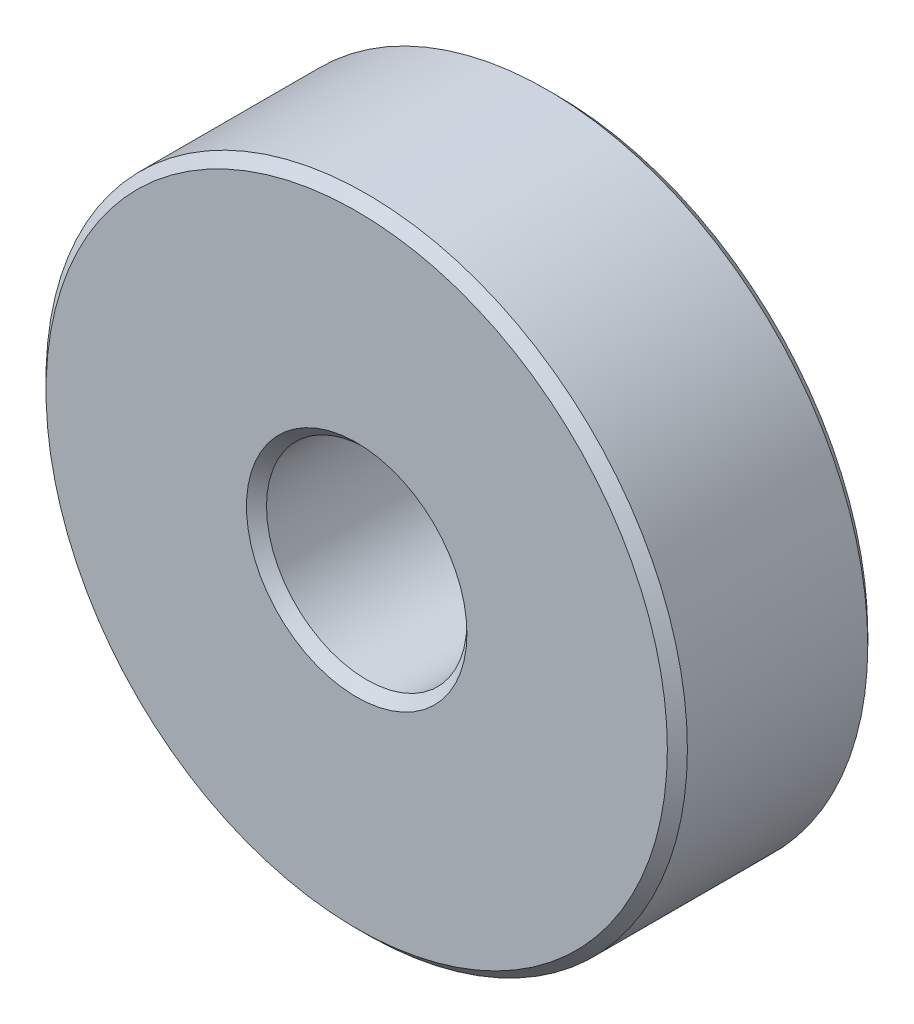
ISO-10303-21;
HEADER;
FILE_DESCRIPTION(('STEP AP214'),'2;1');
FILE_NAME('part.step','',(''),(''),'','','');
FILE_SCHEMA(('AUTOMOTIVE_DESIGN { 1 0 10303 214 1 1 1 1 }'));
ENDSEC;
DATA;
#1=APPLICATION_CONTEXT('core data for automotive mechanical design processes');
#2=APPLICATION_PROTOCOL_DEFINITION('international standard','automotive_design',2000,#1);
#3=PRODUCT_CONTEXT('',#1,'mechanical');
#4=PRODUCT('Part','Part','',(#3));
#5=PRODUCT_RELATED_PRODUCT_CATEGORY('part','',(#4));
#6=PRODUCT_DEFINITION_FORMATION('','',#4);
#7=PRODUCT_DEFINITION_CONTEXT('part definition',#1,'design');
#8=PRODUCT_DEFINITION('design','',#6,#7);
#9=PRODUCT_DEFINITION_SHAPE('','',#8);
#10=(LENGTH_UNIT() NAMED_UNIT(*) SI_UNIT(.MILLI.,.METRE.));
#11=(NAMED_UNIT(*) PLANE_ANGLE_UNIT() SI_UNIT($,.RADIAN.));
#12=(NAMED_UNIT(*) SI_UNIT($,.STERADIAN.) SOLID_ANGLE_UNIT());
#13=UNCERTAINTY_MEASURE_WITH_UNIT(LENGTH_MEASURE(1.E-05),#10,'distance_accuracy_value','');
#14=(GEOMETRIC_REPRESENTATION_CONTEXT(3) GLOBAL_UNCERTAINTY_ASSIGNED_CONTEXT((#13)) GLOBAL_UNIT_ASSIGNED_CONTEXT((#10,
#11,#12)) REPRESENTATION_CONTEXT('',''));
#15=CARTESIAN_POINT('',(0.,0.,0.));
#16=DIRECTION('',(0.,0.,1.));
#17=DIRECTION('',(1.,0.,0.));
#18=AXIS2_PLACEMENT_3D('',#15,#16,#17);
#19=CARTESIAN_POINT('',(0.,0.,2.5));
#20=DIRECTION('',(0.,0.,1.));
#21=DIRECTION('',(1.,0.,0.));
#22=AXIS2_PLACEMENT_3D('',#19,#20,#21);
#23=PLANE('',#22);
#24=CARTESIAN_POINT('',(0.,0.,2.5));
#25=DIRECTION('',(0.,0.,1.));
#26=DIRECTION('',(1.,0.,0.));
#27=AXIS2_PLACEMENT_3D('',#24,#25,#26);
#28=CIRCLE('',#27,2.75);
#29=CARTESIAN_POINT('',(2.75,0.,2.5));
#30=VERTEX_POINT('',#29);
#31=EDGE_CURVE('E42',#30,#30,#28,.F.);
#32=ORIENTED_EDGE('',*,*,#31,.T.);
#33=EDGE_LOOP('',(#32));
#34=FACE_BOUND('',#33,.T.);
#35=CARTESIAN_POINT('',(0.,0.,2.5));
#36=DIRECTION('',(0.,0.,1.));
#37=DIRECTION('',(1.,0.,0.));
#38=AXIS2_PLACEMENT_3D('',#35,#36,#37);
#39=CIRCLE('',#38,7.75);
#40=CARTESIAN_POINT('',(7.75,0.,2.5));
#41=VERTEX_POINT('',#40);
#42=EDGE_CURVE('E46',#41,#41,#39,.T.);
#43=ORIENTED_EDGE('',*,*,#42,.T.);
#44=EDGE_LOOP('',(#43));
#45=FACE_BOUND('',#44,.T.);
#46=ADVANCED_FACE('F31',(#34,#45),#23,.T.);
#47=CARTESIAN_POINT('',(0.,0.,-2.5));
#48=DIRECTION('',(0.,0.,1.));
#49=DIRECTION('',(1.,0.,0.));
#50=AXIS2_PLACEMENT_3D('',#47,#48,#49);
#51=PLANE('',#50);
#52=CARTESIAN_POINT('',(0.,0.,-2.5));
#53=DIRECTION('',(0.,0.,1.));
#54=DIRECTION('',(1.,0.,0.));
#55=AXIS2_PLACEMENT_3D('',#52,#53,#54);
#56=CIRCLE('',#55,2.75);
#57=CARTESIAN_POINT('',(2.75,0.,-2.5));
#58=VERTEX_POINT('',#57);
#59=EDGE_CURVE('E57',#58,#58,#56,.T.);
#60=ORIENTED_EDGE('',*,*,#59,.T.);
#61=EDGE_LOOP('',(#60));
#62=FACE_BOUND('',#61,.T.);
#63=CARTESIAN_POINT('',(0.,0.,-2.5));
#64=DIRECTION('',(0.,0.,1.));
#65=DIRECTION('',(1.,0.,0.));
#66=AXIS2_PLACEMENT_3D('',#63,#64,#65);
#67=CIRCLE('',#66,7.75);
#68=CARTESIAN_POINT('',(7.75,0.,-2.5));
#69=VERTEX_POINT('',#68);
#70=EDGE_CURVE('E60',#69,#69,#67,.F.);
#71=ORIENTED_EDGE('',*,*,#70,.T.);
#72=EDGE_LOOP('',(#71));
#73=FACE_BOUND('',#72,.T.);
#74=ADVANCED_FACE('F64',(#62,#73),#51,.F.);
#75=CARTESIAN_POINT('',(0.,0.,2.5));
#76=DIRECTION('',(0.,0.,-1.));
#77=DIRECTION('',(-1.,0.,0.));
#78=AXIS2_PLACEMENT_3D('',#75,#76,#77);
#79=CYLINDRICAL_SURFACE('',#78,8.);
#80=CARTESIAN_POINT('',(0.,0.,-2.25));
#81=DIRECTION('',(0.,0.,1.));
#82=DIRECTION('',(1.,0.,0.));
#83=AXIS2_PLACEMENT_3D('',#80,#81,#82);
#84=CIRCLE('',#83,8.);
#85=CARTESIAN_POINT('',(8.,0.,-2.25));
#86=VERTEX_POINT('',#85);
#87=EDGE_CURVE('E10',#86,#86,#84,.T.);
#88=ORIENTED_EDGE('',*,*,#87,.T.);
#89=EDGE_LOOP('',(#88));
#90=FACE_BOUND('',#89,.T.);
#91=CARTESIAN_POINT('',(0.,0.,2.25));
#92=DIRECTION('',(0.,0.,1.));
#93=DIRECTION('',(1.,0.,0.));
#94=AXIS2_PLACEMENT_3D('',#91,#92,#93);
#95=CIRCLE('',#94,8.);
#96=CARTESIAN_POINT('',(8.,0.,2.25));
#97=VERTEX_POINT('',#96);
#98=EDGE_CURVE('E38',#97,#97,#95,.F.);
#99=ORIENTED_EDGE('',*,*,#98,.T.);
#100=EDGE_LOOP('',(#99));
#101=FACE_BOUND('',#100,.T.);
#102=ADVANCED_FACE('F84',(#90,#101),#79,.T.);
#103=CARTESIAN_POINT('',(0.,0.,2.5));
#104=DIRECTION('',(0.,0.,-1.));
#105=DIRECTION('',(-1.,0.,0.));
#106=AXIS2_PLACEMENT_3D('',#103,#104,#105);
#107=CYLINDRICAL_SURFACE('',#106,2.5);
#108=CARTESIAN_POINT('',(0.,0.,-2.25));
#109=DIRECTION('',(0.,0.,1.));
#110=DIRECTION('',(1.,0.,0.));
#111=AXIS2_PLACEMENT_3D('',#108,#109,#110);
#112=CIRCLE('',#111,2.5);
#113=CARTESIAN_POINT('',(2.5,0.,-2.25));
#114=VERTEX_POINT('',#113);
#115=EDGE_CURVE('E51',#114,#114,#112,.F.);
#116=ORIENTED_EDGE('',*,*,#115,.T.);
#117=EDGE_LOOP('',(#116));
#118=FACE_BOUND('',#117,.T.);
#119=CARTESIAN_POINT('',(0.,0.,2.25));
#120=DIRECTION('',(0.,0.,1.));
#121=DIRECTION('',(1.,0.,0.));
#122=AXIS2_PLACEMENT_3D('',#119,#120,#121);
#123=CIRCLE('',#122,2.5);
#124=CARTESIAN_POINT('',(2.5,0.,2.25));
#125=VERTEX_POINT('',#124);
#126=EDGE_CURVE('E54',#125,#125,#123,.T.);
#127=ORIENTED_EDGE('',*,*,#126,.T.);
#128=EDGE_LOOP('',(#127));
#129=FACE_BOUND('',#128,.T.);
#130=ADVANCED_FACE('F89',(#118,#129),#107,.F.);
#131=CARTESIAN_POINT('',(0.,0.,-2.5));
#132=DIRECTION('',(0.,0.,-1.));
#133=DIRECTION('',(-1.,0.,0.));
#134=AXIS2_PLACEMENT_3D('',#131,#132,#133);
#135=CONICAL_SURFACE('',#134,2.75,0.785398163397452);
#136=ORIENTED_EDGE('',*,*,#115,.F.);
#137=EDGE_LOOP('',(#136));
#138=FACE_BOUND('',#137,.T.);
#139=ORIENTED_EDGE('',*,*,#59,.F.);
#140=EDGE_LOOP('',(#139));
#141=FACE_BOUND('',#140,.T.);
#142=ADVANCED_FACE('F75',(#138,#141),#135,.F.);
#143=CARTESIAN_POINT('',(0.,0.,2.25));
#144=DIRECTION('',(0.,0.,1.));
#145=DIRECTION('',(1.,0.,0.));
#146=AXIS2_PLACEMENT_3D('',#143,#144,#145);
#147=CONICAL_SURFACE('',#146,2.5,0.785398163397445);
#148=ORIENTED_EDGE('',*,*,#31,.F.);
#149=EDGE_LOOP('',(#148));
#150=FACE_BOUND('',#149,.T.);
#151=ORIENTED_EDGE('',*,*,#126,.F.);
#152=EDGE_LOOP('',(#151));
#153=FACE_BOUND('',#152,.T.);
#154=ADVANCED_FACE('F69',(#150,#153),#147,.F.);
#155=CARTESIAN_POINT('',(0.,0.,-2.25));
#156=DIRECTION('',(0.,0.,1.));
#157=DIRECTION('',(1.,0.,0.));
#158=AXIS2_PLACEMENT_3D('',#155,#156,#157);
#159=CONICAL_SURFACE('',#158,8.,0.785398163397448);
#160=ORIENTED_EDGE('',*,*,#70,.F.);
#161=EDGE_LOOP('',(#160));
#162=FACE_BOUND('',#161,.T.);
#163=ORIENTED_EDGE('',*,*,#87,.F.);
#164=EDGE_LOOP('',(#163));
#165=FACE_BOUND('',#164,.T.);
#166=ADVANCED_FACE('F66',(#162,#165),#159,.T.);
#167=CARTESIAN_POINT('',(0.,0.,2.5));
#168=DIRECTION('',(0.,0.,-1.));
#169=DIRECTION('',(-1.,0.,0.));
#170=AXIS2_PLACEMENT_3D('',#167,#168,#169);
#171=CONICAL_SURFACE('',#170,7.75,0.785398163397441);
#172=ORIENTED_EDGE('',*,*,#98,.F.);
#173=EDGE_LOOP('',(#172));
#174=FACE_BOUND('',#173,.T.);
#175=ORIENTED_EDGE('',*,*,#42,.F.);
#176=EDGE_LOOP('',(#175));
#177=FACE_BOUND('',#176,.T.);
#178=ADVANCED_FACE('F33',(#174,#177),#171,.T.);
#179=CLOSED_SHELL('',(#46,#74,#102,#130,#142,#154,#166,#178));
#180=MANIFOLD_SOLID_BREP('B2',#179);
#181=ADVANCED_BREP_SHAPE_REPRESENTATION('',(#18,#180),#14);
#182=SHAPE_DEFINITION_REPRESENTATION(#9,#181);
ENDSEC;
END-ISO-10303-21;
